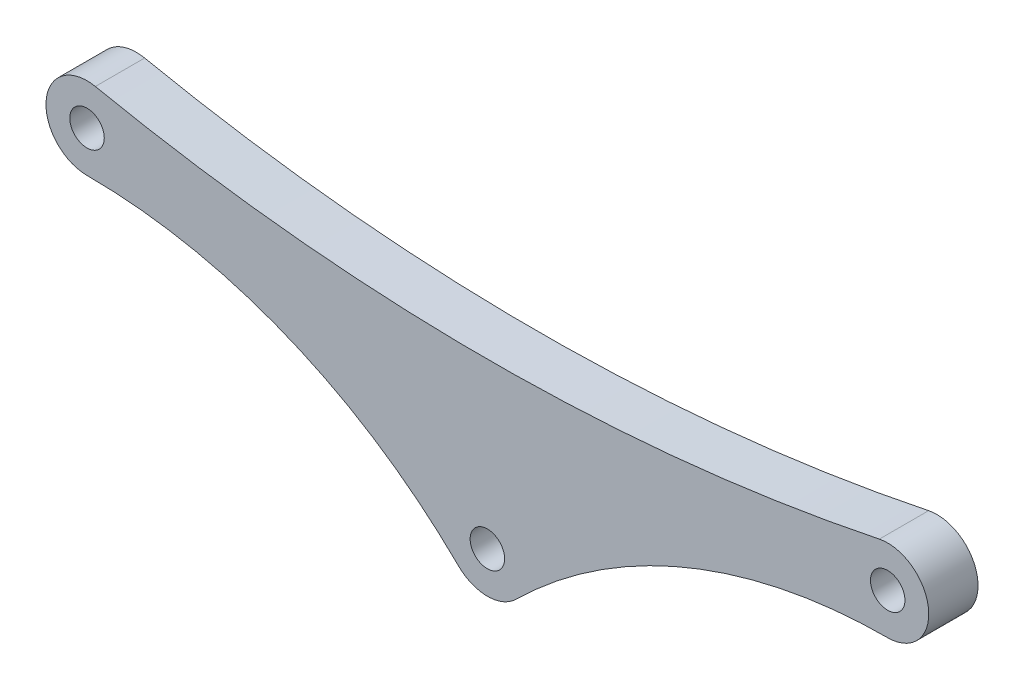
ISO-10303-21;
HEADER;
FILE_DESCRIPTION(('STEP AP214'),'2;1');
FILE_NAME('part.step','',(''),(''),'','','');
FILE_SCHEMA(('AUTOMOTIVE_DESIGN { 1 0 10303 214 1 1 1 1 }'));
ENDSEC;
DATA;
#1=APPLICATION_CONTEXT('core data for automotive mechanical design processes');
#2=APPLICATION_PROTOCOL_DEFINITION('international standard','automotive_design',2000,#1);
#3=PRODUCT_CONTEXT('',#1,'mechanical');
#4=PRODUCT('Part','Part','',(#3));
#5=PRODUCT_RELATED_PRODUCT_CATEGORY('part','',(#4));
#6=PRODUCT_DEFINITION_FORMATION('','',#4);
#7=PRODUCT_DEFINITION_CONTEXT('part definition',#1,'design');
#8=PRODUCT_DEFINITION('design','',#6,#7);
#9=PRODUCT_DEFINITION_SHAPE('','',#8);
#10=(LENGTH_UNIT() NAMED_UNIT(*) SI_UNIT(.MILLI.,.METRE.));
#11=(NAMED_UNIT(*) PLANE_ANGLE_UNIT() SI_UNIT($,.RADIAN.));
#12=(NAMED_UNIT(*) SI_UNIT($,.STERADIAN.) SOLID_ANGLE_UNIT());
#13=UNCERTAINTY_MEASURE_WITH_UNIT(LENGTH_MEASURE(1.E-05),#10,'distance_accuracy_value','');
#14=(GEOMETRIC_REPRESENTATION_CONTEXT(3) GLOBAL_UNCERTAINTY_ASSIGNED_CONTEXT((#13)) GLOBAL_UNIT_ASSIGNED_CONTEXT((#10,
#11,#12)) REPRESENTATION_CONTEXT('',''));
#15=CARTESIAN_POINT('',(0.,0.,0.));
#16=DIRECTION('',(0.,0.,1.));
#17=DIRECTION('',(1.,0.,0.));
#18=AXIS2_PLACEMENT_3D('',#15,#16,#17);
#19=CARTESIAN_POINT('',(24.375,137.578125,6.));
#20=DIRECTION('',(0.,0.,1.));
#21=DIRECTION('',(1.,0.,0.));
#22=AXIS2_PLACEMENT_3D('',#19,#20,#21);
#23=PLANE('',#22);
#24=CARTESIAN_POINT('',(-48.75,20.,6.));
#25=DIRECTION('',(0.,0.,1.));
#26=DIRECTION('',(1.,0.,0.));
#27=AXIS2_PLACEMENT_3D('',#24,#25,#26);
#28=CIRCLE('',#27,2.1);
#29=CARTESIAN_POINT('',(-46.65,20.,6.));
#30=VERTEX_POINT('',#29);
#31=EDGE_CURVE('E186',#30,#30,#28,.T.);
#32=ORIENTED_EDGE('',*,*,#31,.F.);
#33=EDGE_LOOP('',(#32));
#34=FACE_BOUND('',#33,.T.);
#35=CARTESIAN_POINT('',(0.,255.15625,6.));
#36=DIRECTION('',(0.,0.,-1.));
#37=DIRECTION('',(1.,0.,0.));
#38=AXIS2_PLACEMENT_3D('',#35,#36,#37);
#39=CIRCLE('',#38,235.15625);
#40=CARTESIAN_POINT('',(47.7350357839948,24.8959011060508,6.));
#41=VERTEX_POINT('',#40);
#42=CARTESIAN_POINT('',(-47.7350357839948,24.8959011060508,6.));
#43=VERTEX_POINT('',#42);
#44=EDGE_CURVE('E130',#41,#43,#39,.T.);
#45=ORIENTED_EDGE('',*,*,#44,.T.);
#46=CARTESIAN_POINT('',(-48.75,20.,6.));
#47=DIRECTION('',(0.,0.,1.));
#48=DIRECTION('',(1.,0.,0.));
#49=AXIS2_PLACEMENT_3D('',#46,#47,#48);
#50=CIRCLE('',#49,5.);
#51=CARTESIAN_POINT('',(-48.75,15.,6.));
#52=VERTEX_POINT('',#51);
#53=EDGE_CURVE('E88',#43,#52,#50,.T.);
#54=ORIENTED_EDGE('',*,*,#53,.T.);
#55=CARTESIAN_POINT('',(-48.75,-49.4140625,6.));
#56=DIRECTION('',(0.,0.,-1.));
#57=DIRECTION('',(1.,0.,0.));
#58=AXIS2_PLACEMENT_3D('',#55,#56,#57);
#59=CIRCLE('',#58,64.4140625);
#60=CARTESIAN_POINT('',(-3.51153629713,-3.55936972425436,6.));
#61=VERTEX_POINT('',#60);
#62=EDGE_CURVE('E101',#52,#61,#59,.T.);
#63=ORIENTED_EDGE('',*,*,#62,.T.);
#64=CARTESIAN_POINT('',(0.,0.,6.));
#65=DIRECTION('',(0.,0.,1.));
#66=DIRECTION('',(1.,0.,0.));
#67=AXIS2_PLACEMENT_3D('',#64,#65,#66);
#68=CIRCLE('',#67,5.00000000000001);
#69=CARTESIAN_POINT('',(3.51153629713,-3.55936972425436,6.));
#70=VERTEX_POINT('',#69);
#71=EDGE_CURVE('E95',#61,#70,#68,.T.);
#72=ORIENTED_EDGE('',*,*,#71,.T.);
#73=CARTESIAN_POINT('',(48.75,-49.4140625,6.));
#74=DIRECTION('',(0.,0.,-1.));
#75=DIRECTION('',(-1.,0.,0.));
#76=AXIS2_PLACEMENT_3D('',#73,#74,#75);
#77=CIRCLE('',#76,64.4140625);
#78=CARTESIAN_POINT('',(48.75,15.,6.));
#79=VERTEX_POINT('',#78);
#80=EDGE_CURVE('E99',#70,#79,#77,.T.);
#81=ORIENTED_EDGE('',*,*,#80,.T.);
#82=CARTESIAN_POINT('',(48.75,20.,6.));
#83=DIRECTION('',(0.,0.,1.));
#84=DIRECTION('',(-1.,0.,0.));
#85=AXIS2_PLACEMENT_3D('',#82,#83,#84);
#86=CIRCLE('',#85,5.);
#87=EDGE_CURVE('E51',#79,#41,#86,.T.);
#88=ORIENTED_EDGE('',*,*,#87,.T.);
#89=EDGE_LOOP('',(#45,#54,#63,#72,#81,#88));
#90=FACE_BOUND('',#89,.T.);
#91=CARTESIAN_POINT('',(0.,0.,6.));
#92=DIRECTION('',(0.,0.,1.));
#93=DIRECTION('',(1.,0.,0.));
#94=AXIS2_PLACEMENT_3D('',#91,#92,#93);
#95=CIRCLE('',#94,2.1);
#96=CARTESIAN_POINT('',(2.1,0.,6.));
#97=VERTEX_POINT('',#96);
#98=EDGE_CURVE('E123',#97,#97,#95,.T.);
#99=ORIENTED_EDGE('',*,*,#98,.F.);
#100=EDGE_LOOP('',(#99));
#101=FACE_BOUND('',#100,.T.);
#102=CARTESIAN_POINT('',(48.75,20.,6.));
#103=DIRECTION('',(0.,0.,1.));
#104=DIRECTION('',(-1.,0.,0.));
#105=AXIS2_PLACEMENT_3D('',#102,#103,#104);
#106=CIRCLE('',#105,2.1);
#107=CARTESIAN_POINT('',(46.65,20.,6.));
#108=VERTEX_POINT('',#107);
#109=EDGE_CURVE('E177',#108,#108,#106,.T.);
#110=ORIENTED_EDGE('',*,*,#109,.F.);
#111=EDGE_LOOP('',(#110));
#112=FACE_BOUND('',#111,.T.);
#113=ADVANCED_FACE('F34',(#34,#90,#101,#112),#23,.T.);
#114=CARTESIAN_POINT('',(24.375,137.578125,0.));
#115=DIRECTION('',(0.,0.,1.));
#116=DIRECTION('',(1.,0.,0.));
#117=AXIS2_PLACEMENT_3D('',#114,#115,#116);
#118=PLANE('',#117);
#119=CARTESIAN_POINT('',(-48.75,20.,0.));
#120=DIRECTION('',(0.,0.,1.));
#121=DIRECTION('',(1.,0.,0.));
#122=AXIS2_PLACEMENT_3D('',#119,#120,#121);
#123=CIRCLE('',#122,2.1);
#124=CARTESIAN_POINT('',(-46.65,20.,0.));
#125=VERTEX_POINT('',#124);
#126=EDGE_CURVE('E183',#125,#125,#123,.T.);
#127=ORIENTED_EDGE('',*,*,#126,.T.);
#128=EDGE_LOOP('',(#127));
#129=FACE_BOUND('',#128,.T.);
#130=CARTESIAN_POINT('',(0.,255.15625,0.));
#131=DIRECTION('',(0.,0.,-1.));
#132=DIRECTION('',(1.,0.,0.));
#133=AXIS2_PLACEMENT_3D('',#130,#131,#132);
#134=CIRCLE('',#133,235.15625);
#135=CARTESIAN_POINT('',(47.7350357839948,24.8959011060508,0.));
#136=VERTEX_POINT('',#135);
#137=CARTESIAN_POINT('',(-47.7350357839948,24.8959011060508,0.));
#138=VERTEX_POINT('',#137);
#139=EDGE_CURVE('E119',#136,#138,#134,.T.);
#140=ORIENTED_EDGE('',*,*,#139,.F.);
#141=CARTESIAN_POINT('',(48.75,20.,0.));
#142=DIRECTION('',(0.,0.,1.));
#143=DIRECTION('',(-1.,0.,0.));
#144=AXIS2_PLACEMENT_3D('',#141,#142,#143);
#145=CIRCLE('',#144,5.);
#146=CARTESIAN_POINT('',(48.75,15.,0.));
#147=VERTEX_POINT('',#146);
#148=EDGE_CURVE('E80',#147,#136,#145,.T.);
#149=ORIENTED_EDGE('',*,*,#148,.F.);
#150=CARTESIAN_POINT('',(48.75,-49.4140625,0.));
#151=DIRECTION('',(0.,0.,-1.));
#152=DIRECTION('',(-1.,0.,0.));
#153=AXIS2_PLACEMENT_3D('',#150,#151,#152);
#154=CIRCLE('',#153,64.4140625);
#155=CARTESIAN_POINT('',(3.51153629713,-3.55936972425436,0.));
#156=VERTEX_POINT('',#155);
#157=EDGE_CURVE('E74',#156,#147,#154,.T.);
#158=ORIENTED_EDGE('',*,*,#157,.F.);
#159=CARTESIAN_POINT('',(0.,0.,0.));
#160=DIRECTION('',(0.,0.,1.));
#161=DIRECTION('',(1.,0.,0.));
#162=AXIS2_PLACEMENT_3D('',#159,#160,#161);
#163=CIRCLE('',#162,5.00000000000001);
#164=CARTESIAN_POINT('',(-3.51153629713,-3.55936972425436,0.));
#165=VERTEX_POINT('',#164);
#166=EDGE_CURVE('E109',#165,#156,#163,.T.);
#167=ORIENTED_EDGE('',*,*,#166,.F.);
#168=CARTESIAN_POINT('',(-48.75,-49.4140625,0.));
#169=DIRECTION('',(0.,0.,-1.));
#170=DIRECTION('',(1.,0.,0.));
#171=AXIS2_PLACEMENT_3D('',#168,#169,#170);
#172=CIRCLE('',#171,64.4140625);
#173=CARTESIAN_POINT('',(-48.75,15.,0.));
#174=VERTEX_POINT('',#173);
#175=EDGE_CURVE('E125',#174,#165,#172,.T.);
#176=ORIENTED_EDGE('',*,*,#175,.F.);
#177=CARTESIAN_POINT('',(-48.75,20.,0.));
#178=DIRECTION('',(0.,0.,1.));
#179=DIRECTION('',(1.,0.,0.));
#180=AXIS2_PLACEMENT_3D('',#177,#178,#179);
#181=CIRCLE('',#180,5.);
#182=EDGE_CURVE('E122',#138,#174,#181,.T.);
#183=ORIENTED_EDGE('',*,*,#182,.F.);
#184=EDGE_LOOP('',(#140,#149,#158,#167,#176,#183));
#185=FACE_BOUND('',#184,.T.);
#186=CARTESIAN_POINT('',(0.,0.,0.));
#187=DIRECTION('',(0.,0.,1.));
#188=DIRECTION('',(1.,0.,0.));
#189=AXIS2_PLACEMENT_3D('',#186,#187,#188);
#190=CIRCLE('',#189,2.1);
#191=CARTESIAN_POINT('',(2.1,0.,0.));
#192=VERTEX_POINT('',#191);
#193=EDGE_CURVE('E189',#192,#192,#190,.T.);
#194=ORIENTED_EDGE('',*,*,#193,.T.);
#195=EDGE_LOOP('',(#194));
#196=FACE_BOUND('',#195,.T.);
#197=CARTESIAN_POINT('',(48.75,20.,0.));
#198=DIRECTION('',(0.,0.,1.));
#199=DIRECTION('',(-1.,0.,0.));
#200=AXIS2_PLACEMENT_3D('',#197,#198,#199);
#201=CIRCLE('',#200,2.1);
#202=CARTESIAN_POINT('',(46.65,20.,0.));
#203=VERTEX_POINT('',#202);
#204=EDGE_CURVE('E180',#203,#203,#201,.T.);
#205=ORIENTED_EDGE('',*,*,#204,.T.);
#206=EDGE_LOOP('',(#205));
#207=FACE_BOUND('',#206,.T.);
#208=ADVANCED_FACE('F139',(#129,#185,#196,#207),#118,.F.);
#209=CARTESIAN_POINT('',(0.,255.15625,6.));
#210=DIRECTION('',(0.,0.,-1.));
#211=DIRECTION('',(-1.,0.,0.));
#212=AXIS2_PLACEMENT_3D('',#209,#210,#211);
#213=CYLINDRICAL_SURFACE('',#212,235.15625);
#214=ORIENTED_EDGE('',*,*,#139,.T.);
#215=DIRECTION('',(0.,0.,-1.));
#216=VECTOR('',#215,1.);
#217=CARTESIAN_POINT('',(-47.7350357839948,24.8959011060508,6.));
#218=LINE('',#217,#216);
#219=EDGE_CURVE('E11',#43,#138,#218,.T.);
#220=ORIENTED_EDGE('',*,*,#219,.F.);
#221=ORIENTED_EDGE('',*,*,#44,.F.);
#222=DIRECTION('',(0.,0.,-1.));
#223=VECTOR('',#222,1.);
#224=CARTESIAN_POINT('',(47.7350357839948,24.8959011060508,6.));
#225=LINE('',#224,#223);
#226=EDGE_CURVE('E115',#41,#136,#225,.T.);
#227=ORIENTED_EDGE('',*,*,#226,.T.);
#228=EDGE_LOOP('',(#214,#220,#221,#227));
#229=FACE_BOUND('',#228,.T.);
#230=ADVANCED_FACE('F36',(#229),#213,.F.);
#231=CARTESIAN_POINT('',(-48.75,20.,6.));
#232=DIRECTION('',(0.,0.,-1.));
#233=DIRECTION('',(-1.,0.,0.));
#234=AXIS2_PLACEMENT_3D('',#231,#232,#233);
#235=CYLINDRICAL_SURFACE('',#234,5.);
#236=ORIENTED_EDGE('',*,*,#182,.T.);
#237=DIRECTION('',(0.,0.,-1.));
#238=VECTOR('',#237,1.);
#239=CARTESIAN_POINT('',(-48.75,15.,6.));
#240=LINE('',#239,#238);
#241=EDGE_CURVE('E43',#52,#174,#240,.T.);
#242=ORIENTED_EDGE('',*,*,#241,.F.);
#243=ORIENTED_EDGE('',*,*,#53,.F.);
#244=ORIENTED_EDGE('',*,*,#219,.T.);
#245=EDGE_LOOP('',(#236,#242,#243,#244));
#246=FACE_BOUND('',#245,.T.);
#247=ADVANCED_FACE('F238',(#246),#235,.T.);
#248=CARTESIAN_POINT('',(-48.75,-49.4140625,6.));
#249=DIRECTION('',(0.,0.,-1.));
#250=DIRECTION('',(-1.,0.,0.));
#251=AXIS2_PLACEMENT_3D('',#248,#249,#250);
#252=CYLINDRICAL_SURFACE('',#251,64.4140625);
#253=ORIENTED_EDGE('',*,*,#175,.T.);
#254=DIRECTION('',(0.,0.,-1.));
#255=VECTOR('',#254,1.);
#256=CARTESIAN_POINT('',(-3.51153629713,-3.55936972425436,6.));
#257=LINE('',#256,#255);
#258=EDGE_CURVE('E110',#61,#165,#257,.T.);
#259=ORIENTED_EDGE('',*,*,#258,.F.);
#260=ORIENTED_EDGE('',*,*,#62,.F.);
#261=ORIENTED_EDGE('',*,*,#241,.T.);
#262=EDGE_LOOP('',(#253,#259,#260,#261));
#263=FACE_BOUND('',#262,.T.);
#264=ADVANCED_FACE('F136',(#263),#252,.F.);
#265=CARTESIAN_POINT('',(0.,0.,6.));
#266=DIRECTION('',(0.,0.,-1.));
#267=DIRECTION('',(-1.,0.,0.));
#268=AXIS2_PLACEMENT_3D('',#265,#266,#267);
#269=CYLINDRICAL_SURFACE('',#268,5.00000000000001);
#270=ORIENTED_EDGE('',*,*,#166,.T.);
#271=DIRECTION('',(0.,0.,-1.));
#272=VECTOR('',#271,1.);
#273=CARTESIAN_POINT('',(3.51153629713,-3.55936972425436,6.));
#274=LINE('',#273,#272);
#275=EDGE_CURVE('E106',#70,#156,#274,.T.);
#276=ORIENTED_EDGE('',*,*,#275,.F.);
#277=ORIENTED_EDGE('',*,*,#71,.F.);
#278=ORIENTED_EDGE('',*,*,#258,.T.);
#279=EDGE_LOOP('',(#270,#276,#277,#278));
#280=FACE_BOUND('',#279,.T.);
#281=ADVANCED_FACE('F107',(#280),#269,.T.);
#282=CARTESIAN_POINT('',(48.75,-49.4140625,6.));
#283=DIRECTION('',(0.,0.,-1.));
#284=DIRECTION('',(-1.,0.,0.));
#285=AXIS2_PLACEMENT_3D('',#282,#283,#284);
#286=CYLINDRICAL_SURFACE('',#285,64.4140625);
#287=ORIENTED_EDGE('',*,*,#157,.T.);
#288=DIRECTION('',(0.,0.,-1.));
#289=VECTOR('',#288,1.);
#290=CARTESIAN_POINT('',(48.75,15.,6.));
#291=LINE('',#290,#289);
#292=EDGE_CURVE('E111',#79,#147,#291,.T.);
#293=ORIENTED_EDGE('',*,*,#292,.F.);
#294=ORIENTED_EDGE('',*,*,#80,.F.);
#295=ORIENTED_EDGE('',*,*,#275,.T.);
#296=EDGE_LOOP('',(#287,#293,#294,#295));
#297=FACE_BOUND('',#296,.T.);
#298=ADVANCED_FACE('F113',(#297),#286,.F.);
#299=CARTESIAN_POINT('',(48.75,20.,6.));
#300=DIRECTION('',(0.,0.,-1.));
#301=DIRECTION('',(-1.,0.,0.));
#302=AXIS2_PLACEMENT_3D('',#299,#300,#301);
#303=CYLINDRICAL_SURFACE('',#302,5.);
#304=ORIENTED_EDGE('',*,*,#148,.T.);
#305=ORIENTED_EDGE('',*,*,#226,.F.);
#306=ORIENTED_EDGE('',*,*,#87,.F.);
#307=ORIENTED_EDGE('',*,*,#292,.T.);
#308=EDGE_LOOP('',(#304,#305,#306,#307));
#309=FACE_BOUND('',#308,.T.);
#310=ADVANCED_FACE('F144',(#309),#303,.T.);
#311=CARTESIAN_POINT('',(0.,0.,6.));
#312=DIRECTION('',(0.,0.,-1.));
#313=DIRECTION('',(-1.,0.,0.));
#314=AXIS2_PLACEMENT_3D('',#311,#312,#313);
#315=CYLINDRICAL_SURFACE('',#314,2.1);
#316=ORIENTED_EDGE('',*,*,#98,.T.);
#317=EDGE_LOOP('',(#316));
#318=FACE_BOUND('',#317,.T.);
#319=ORIENTED_EDGE('',*,*,#193,.F.);
#320=EDGE_LOOP('',(#319));
#321=FACE_BOUND('',#320,.T.);
#322=ADVANCED_FACE('F146',(#318,#321),#315,.F.);
#323=CARTESIAN_POINT('',(-48.75,20.,6.));
#324=DIRECTION('',(0.,0.,-1.));
#325=DIRECTION('',(-1.,0.,0.));
#326=AXIS2_PLACEMENT_3D('',#323,#324,#325);
#327=CYLINDRICAL_SURFACE('',#326,2.1);
#328=ORIENTED_EDGE('',*,*,#31,.T.);
#329=EDGE_LOOP('',(#328));
#330=FACE_BOUND('',#329,.T.);
#331=ORIENTED_EDGE('',*,*,#126,.F.);
#332=EDGE_LOOP('',(#331));
#333=FACE_BOUND('',#332,.T.);
#334=ADVANCED_FACE('F152',(#330,#333),#327,.F.);
#335=CARTESIAN_POINT('',(48.75,20.,6.));
#336=DIRECTION('',(0.,0.,-1.));
#337=DIRECTION('',(-1.,0.,0.));
#338=AXIS2_PLACEMENT_3D('',#335,#336,#337);
#339=CYLINDRICAL_SURFACE('',#338,2.1);
#340=ORIENTED_EDGE('',*,*,#109,.T.);
#341=EDGE_LOOP('',(#340));
#342=FACE_BOUND('',#341,.T.);
#343=ORIENTED_EDGE('',*,*,#204,.F.);
#344=EDGE_LOOP('',(#343));
#345=FACE_BOUND('',#344,.T.);
#346=ADVANCED_FACE('F168',(#342,#345),#339,.F.);
#347=CLOSED_SHELL('',(#113,#208,#230,#247,#264,#281,#298,#310,#322,#334,#346));
#348=MANIFOLD_SOLID_BREP('B2',#347);
#349=ADVANCED_BREP_SHAPE_REPRESENTATION('',(#18,#348),#14);
#350=SHAPE_DEFINITION_REPRESENTATION(#9,#349);
ENDSEC;
END-ISO-10303-21;
